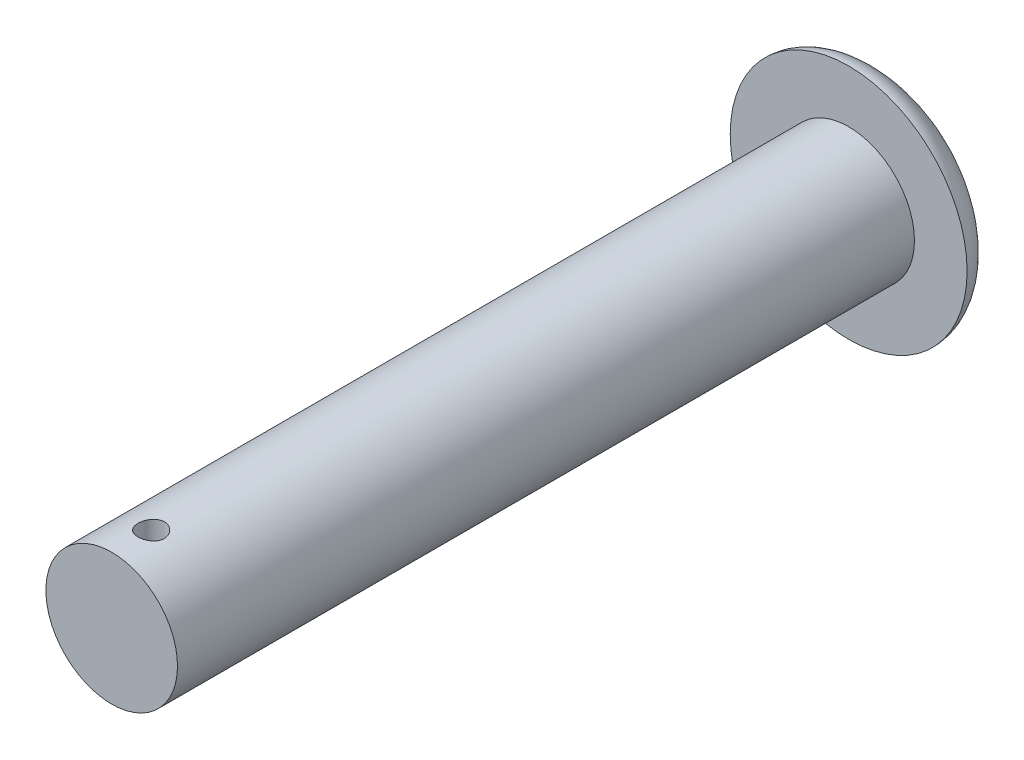
ISO-10303-21;
HEADER;
FILE_DESCRIPTION(('STEP AP214'),'2;1');
FILE_NAME('part.step','',(''),(''),'','','');
FILE_SCHEMA(('AUTOMOTIVE_DESIGN { 1 0 10303 214 1 1 1 1 }'));
ENDSEC;
DATA;
#1=APPLICATION_CONTEXT('core data for automotive mechanical design processes');
#2=APPLICATION_PROTOCOL_DEFINITION('international standard','automotive_design',2000,#1);
#3=PRODUCT_CONTEXT('',#1,'mechanical');
#4=PRODUCT('Part','Part','',(#3));
#5=PRODUCT_RELATED_PRODUCT_CATEGORY('part','',(#4));
#6=PRODUCT_DEFINITION_FORMATION('','',#4);
#7=PRODUCT_DEFINITION_CONTEXT('part definition',#1,'design');
#8=PRODUCT_DEFINITION('design','',#6,#7);
#9=PRODUCT_DEFINITION_SHAPE('','',#8);
#10=(LENGTH_UNIT() NAMED_UNIT(*) SI_UNIT(.MILLI.,.METRE.));
#11=(NAMED_UNIT(*) PLANE_ANGLE_UNIT() SI_UNIT($,.RADIAN.));
#12=(NAMED_UNIT(*) SI_UNIT($,.STERADIAN.) SOLID_ANGLE_UNIT());
#13=UNCERTAINTY_MEASURE_WITH_UNIT(LENGTH_MEASURE(1.E-05),#10,'distance_accuracy_value','');
#14=(GEOMETRIC_REPRESENTATION_CONTEXT(3) GLOBAL_UNCERTAINTY_ASSIGNED_CONTEXT((#13)) GLOBAL_UNIT_ASSIGNED_CONTEXT((#10,
#11,#12)) REPRESENTATION_CONTEXT('',''));
#15=CARTESIAN_POINT('',(0.,0.,0.));
#16=DIRECTION('',(0.,0.,1.));
#17=DIRECTION('',(1.,0.,0.));
#18=AXIS2_PLACEMENT_3D('',#15,#16,#17);
#19=CARTESIAN_POINT('',(-2.5,0.,0.));
#20=DIRECTION('',(0.,0.,-1.));
#21=DIRECTION('',(-1.,0.,0.));
#22=AXIS2_PLACEMENT_3D('',#19,#20,#21);
#23=PLANE('',#22);
#24=CARTESIAN_POINT('',(0.,0.,0.));
#25=DIRECTION('',(0.,0.,1.));
#26=DIRECTION('',(1.,0.,0.));
#27=AXIS2_PLACEMENT_3D('',#24,#25,#26);
#28=CIRCLE('',#27,2.5);
#29=CARTESIAN_POINT('',(2.5,0.,0.));
#30=VERTEX_POINT('',#29);
#31=EDGE_CURVE('E69',#30,#30,#28,.T.);
#32=ORIENTED_EDGE('',*,*,#31,.T.);
#33=EDGE_LOOP('',(#32));
#34=FACE_BOUND('',#33,.T.);
#35=ADVANCED_FACE('F37',(#34),#23,.F.);
#36=CARTESIAN_POINT('',(0.,0.,-28.));
#37=DIRECTION('',(0.,1.,0.));
#38=DIRECTION('',(-1.,0.,0.));
#39=AXIS2_PLACEMENT_3D('',#36,#37,#38);
#40=ELLIPSE('',#39,4.5,2.);
#41=TRIMMED_CURVE('',#40,(PARAMETER_VALUE(4.71238898038469)),
(PARAMETER_VALUE(7.85398163397448)),.T.,.PARAMETER.);
#42=CARTESIAN_POINT('',(0.,0.,0.));
#43=DIRECTION('',(0.,0.,1.));
#44=AXIS1_PLACEMENT('',#42,#43);
#45=SURFACE_OF_REVOLUTION('',#41,#44);
#46=CARTESIAN_POINT('',(0.,0.,-28.));
#47=DIRECTION('',(0.,0.,1.));
#48=DIRECTION('',(1.,0.,0.));
#49=AXIS2_PLACEMENT_3D('',#46,#47,#48);
#50=CIRCLE('',#49,4.5);
#51=CARTESIAN_POINT('',(4.5,0.,-28.));
#52=VERTEX_POINT('',#51);
#53=EDGE_CURVE('E11',#52,#52,#50,.T.);
#54=ORIENTED_EDGE('',*,*,#53,.F.);
#55=EDGE_LOOP('',(#54));
#56=FACE_BOUND('',#55,.T.);
#57=CARTESIAN_POINT('',(0.,0.,-30.));
#58=VERTEX_POINT('',#57);
#59=VERTEX_LOOP('',#58);
#60=FACE_BOUND('',#59,.T.);
#61=ADVANCED_FACE('F53',(#56,#60),#45,.T.);
#62=CARTESIAN_POINT('',(-4.5,0.,-28.));
#63=DIRECTION('',(0.,0.,-1.));
#64=DIRECTION('',(-1.,0.,0.));
#65=AXIS2_PLACEMENT_3D('',#62,#63,#64);
#66=PLANE('',#65);
#67=CARTESIAN_POINT('',(0.,0.,-28.));
#68=DIRECTION('',(0.,0.,1.));
#69=DIRECTION('',(1.,0.,0.));
#70=AXIS2_PLACEMENT_3D('',#67,#68,#69);
#71=CIRCLE('',#70,2.5);
#72=CARTESIAN_POINT('',(2.5,0.,-28.));
#73=VERTEX_POINT('',#72);
#74=EDGE_CURVE('E49',#73,#73,#71,.T.);
#75=ORIENTED_EDGE('',*,*,#74,.F.);
#76=EDGE_LOOP('',(#75));
#77=FACE_BOUND('',#76,.T.);
#78=ORIENTED_EDGE('',*,*,#53,.T.);
#79=EDGE_LOOP('',(#78));
#80=FACE_BOUND('',#79,.T.);
#81=ADVANCED_FACE('F55',(#77,#80),#66,.F.);
#82=CARTESIAN_POINT('',(0.,0.,0.));
#83=DIRECTION('',(0.,0.,1.));
#84=DIRECTION('',(1.,0.,0.));
#85=AXIS2_PLACEMENT_3D('',#82,#83,#84);
#86=CYLINDRICAL_SURFACE('',#85,2.5);
#87=CARTESIAN_POINT('',(0.,-2.5,-1.));
#88=CARTESIAN_POINT('',(0.0277884533963166,-2.49999948790436,-1.00000102224917));
#89=CARTESIAN_POINT('',(0.0555898301007612,-2.49953192589115,-1.00232442148382));
#90=CARTESIAN_POINT('',(0.11040675384451,-2.49771182811616,-1.01154925005762));
#91=CARTESIAN_POINT('',(0.137421658770678,-2.49635858930093,-1.01845431640075));
#92=CARTESIAN_POINT('',(0.189865152631656,-2.49291824639143,-1.03662063681039));
#93=CARTESIAN_POINT('',(0.215295233966567,-2.49083184538359,-1.04787771842234));
#94=CARTESIAN_POINT('',(0.263903994432113,-2.48615199017657,-1.07441612375565));
#95=CARTESIAN_POINT('',(0.287082807537906,-2.48355856617854,-1.0896972078036));
#96=CARTESIAN_POINT('',(0.330846738657432,-2.47811082664985,-1.12406924714572));
#97=CARTESIAN_POINT('',(0.351396975579262,-2.47525372752174,-1.1432041776956));
#98=CARTESIAN_POINT('',(0.389018378304014,-2.46962090226294,-1.18464620819585));
#99=CARTESIAN_POINT('',(0.406089272385212,-2.46684518250212,-1.20695355566756));
#100=CARTESIAN_POINT('',(0.43641587667381,-2.46166220906308,-1.25435809650594));
#101=CARTESIAN_POINT('',(0.449635469432933,-2.45925853682473,-1.27947882189818));
#102=CARTESIAN_POINT('',(0.471652833290154,-2.45513134029209,-1.33164090950204));
#103=CARTESIAN_POINT('',(0.480451041218619,-2.45340774880981,-1.35868208167317));
#104=CARTESIAN_POINT('',(0.493262649942413,-2.45086402626102,-1.41354218195396));
#105=CARTESIAN_POINT('',(0.497337248979388,-2.45003235053594,-1.44134627207111));
#106=CARTESIAN_POINT('',(0.50077606386306,-2.44933187530314,-1.49725491068217));
#107=CARTESIAN_POINT('',(0.50014076135675,-2.4494629773392,-1.52535942816007));
#108=CARTESIAN_POINT('',(0.494227286550909,-2.45066275574092,-1.5806233940105));
#109=CARTESIAN_POINT('',(0.489019270121953,-2.45171726429382,-1.60779070281366));
#110=CARTESIAN_POINT('',(0.474218942311525,-2.45462273080001,-1.6608580383315));
#111=CARTESIAN_POINT('',(0.46462642155034,-2.45647372678889,-1.6867580044595));
#112=CARTESIAN_POINT('',(0.44126239183736,-2.46077809250204,-1.7367576308518));
#113=CARTESIAN_POINT('',(0.427463075616057,-2.46323544906852,-1.76084393978459));
#114=CARTESIAN_POINT('',(0.39609678728634,-2.46847309386531,-1.80638542498641));
#115=CARTESIAN_POINT('',(0.378529382178415,-2.47125341919183,-1.82784029842558));
#116=CARTESIAN_POINT('',(0.339749967280292,-2.47688510620731,-1.86791470122847));
#117=CARTESIAN_POINT('',(0.318478080606223,-2.47973684605452,-1.88647628392957));
#118=CARTESIAN_POINT('',(0.273092512031005,-2.48514424357204,-1.91977692315061));
#119=CARTESIAN_POINT('',(0.248978793689695,-2.48769989744487,-1.93451593064679));
#120=CARTESIAN_POINT('',(0.19852969343946,-2.49223345080444,-1.95976375461299));
#121=CARTESIAN_POINT('',(0.17219090979265,-2.49421044424136,-1.97026594682227));
#122=CARTESIAN_POINT('',(0.118074488224333,-2.49735704493929,-1.98668023701928));
#123=CARTESIAN_POINT('',(0.0902970250362249,-2.49852675000266,-1.99259289103681));
#124=CARTESIAN_POINT('',(0.0345897028135754,-2.49991335933434,-1.99957822689714));
#125=CARTESIAN_POINT('',(0.00667016416278829,-2.50014587326235,-2.00073020977013));
#126=CARTESIAN_POINT('',(-0.0489624670963569,-2.49967525965051,-1.99837507052891));
#127=CARTESIAN_POINT('',(-0.0766755712218965,-2.49897218470723,-1.9948682103237));
#128=CARTESIAN_POINT('',(-0.13085282997327,-2.49671916004009,-1.98336081322802));
#129=CARTESIAN_POINT('',(-0.157325974169952,-2.49517688202103,-1.97540096575105));
#130=CARTESIAN_POINT('',(-0.208561813749834,-2.49141776030516,-1.9552580086721));
#131=CARTESIAN_POINT('',(-0.23332438081877,-2.48920086607113,-1.94307458266159));
#132=CARTESIAN_POINT('',(-0.280770586843109,-2.48429955766647,-1.91465875467434));
#133=CARTESIAN_POINT('',(-0.303425063376094,-2.48160975218526,-1.89837860948053));
#134=CARTESIAN_POINT('',(-0.345709009559603,-2.47607367414941,-1.86229540439636));
#135=CARTESIAN_POINT('',(-0.365338154465381,-2.47322738484194,-1.84249196680007));
#136=CARTESIAN_POINT('',(-0.401320295387088,-2.46764651778482,-1.79956332405444));
#137=CARTESIAN_POINT('',(-0.417618851224328,-2.46491430116652,-1.77639212788933));
#138=CARTESIAN_POINT('',(-0.446092710025603,-2.45992095898097,-1.72759431932166));
#139=CARTESIAN_POINT('',(-0.458268177961451,-2.45765981456671,-1.70196780521322));
#140=CARTESIAN_POINT('',(-0.47807592079098,-2.45388370292191,-1.64911587692523));
#141=CARTESIAN_POINT('',(-0.485731749895525,-2.45236487436093,-1.62189957939484));
#142=CARTESIAN_POINT('',(-0.496354325813598,-2.45023718396013,-1.56653327325455));
#143=CARTESIAN_POINT('',(-0.499321684112556,-2.44962820345556,-1.53838338689533));
#144=CARTESIAN_POINT('',(-0.500460455433734,-2.4493957481569,-1.48249556772784));
#145=CARTESIAN_POINT('',(-0.498717894035448,-2.4497545959465,-1.4547594255365));
#146=CARTESIAN_POINT('',(-0.49067615205003,-2.45137786742307,-1.39998417504749));
#147=CARTESIAN_POINT('',(-0.484377008064649,-2.45264228383585,-1.3729450611526));
#148=CARTESIAN_POINT('',(-0.467439284249477,-2.45592632109579,-1.32038614437973));
#149=CARTESIAN_POINT('',(-0.456811253358672,-2.45794410509415,-1.29486281974879));
#150=CARTESIAN_POINT('',(-0.431527322300802,-2.46250857487085,-1.24594813963278));
#151=CARTESIAN_POINT('',(-0.416871084387441,-2.46505530499447,-1.22255696313743));
#152=CARTESIAN_POINT('',(-0.383652957393207,-2.47044480261613,-1.17814221392484));
#153=CARTESIAN_POINT('',(-0.36502894361759,-2.4732918645485,-1.1571656173662));
#154=CARTESIAN_POINT('',(-0.32453218450657,-2.47893040935977,-1.11860689723541));
#155=CARTESIAN_POINT('',(-0.302658693576667,-2.48172187931592,-1.10102555484136));
#156=CARTESIAN_POINT('',(-0.256008814544123,-2.48696916193986,-1.06958267802678));
#157=CARTESIAN_POINT('',(-0.231204442214917,-2.48942115609623,-1.05576199835999));
#158=CARTESIAN_POINT('',(-0.179583180470366,-2.493675625425,-1.0325069387017));
#159=CARTESIAN_POINT('',(-0.152768130431563,-2.49547868569308,-1.02306860523375));
#160=CARTESIAN_POINT('',(-0.10491074446189,-2.49788186297685,-1.01067402597764));
#161=CARTESIAN_POINT('',(-0.0841408320068923,-2.49867151579226,-1.00667840314612));
#162=CARTESIAN_POINT('',(-0.0422497626050335,-2.49973077069946,-1.00134104382082));
#163=CARTESIAN_POINT('',(-0.0211286168743095,-2.50000038936577,-0.999999222745116));
#164=CARTESIAN_POINT('',(0.,-2.5,-1.));
#165=B_SPLINE_CURVE_WITH_KNOTS('',3,(#87,#88,#89,#90,#91,#92,#93,#94,#95,#96,#97,#98,#99,#100,
#101,#102,#103,#104,#105,#106,#107,#108,#109,#110,#111,#112,#113,#114,#115,#116,#117,#118,#119,
#120,#121,#122,#123,#124,#125,#126,#127,#128,#129,#130,#131,#132,#133,#134,#135,#136,#137,#138,
#139,#140,#141,#142,#143,#144,#145,#146,#147,#148,#149,#150,#151,#152,#153,#154,#155,#156,#157,
#158,#159,#160,#161,#162,#163,#164),.UNSPECIFIED.,.T.,.F.,(4,2,2,2,2,2,2,2,2,2,2,2,2,2,2,2,2,2,
2,2,2,2,2,2,2,2,2,2,2,2,2,2,2,2,2,2,2,2,4),(0.,0.0832880653306292,0.166642325345661,
0.249916867625171,0.333186451115431,0.417466335056093,0.501752798373682,0.586805975029613,
0.671850746825987,0.755780925517936,0.839702521406126,0.922358635031391,1.00501869626865,
1.08823745101796,1.17146577374835,1.25619126245675,1.3409178376991,1.42577637427012,
1.51062462849018,1.59405367838133,1.67747803828934,1.76015226975362,1.84283269608011,
1.92652533016679,2.01022694172965,2.09520314289613,2.18017594361733,2.26470190516362,
2.34921684165207,2.43219861283851,2.51517971746304,2.59795980626555,2.68074683790933,
2.76494038119571,2.84915327266465,2.93424748337818,3.01926477758759,3.08259387644947,
3.14592095685498),.UNSPECIFIED.);
#166=CARTESIAN_POINT('',(0.,-2.5,-1.));
#167=VERTEX_POINT('',#166);
#168=EDGE_CURVE('E40',#167,#167,#165,.T.);
#169=ORIENTED_EDGE('',*,*,#168,.T.);
#170=EDGE_LOOP('',(#169));
#171=FACE_BOUND('',#170,.T.);
#172=CARTESIAN_POINT('',(0.,2.5,-1.));
#173=CARTESIAN_POINT('',(-0.0277884533963166,2.49999948790436,-1.00000102224917));
#174=CARTESIAN_POINT('',(-0.0555898301007612,2.49953192589115,-1.00232442148382));
#175=CARTESIAN_POINT('',(-0.11040675384451,2.49771182811616,-1.01154925005762));
#176=CARTESIAN_POINT('',(-0.137421658770678,2.49635858930093,-1.01845431640075));
#177=CARTESIAN_POINT('',(-0.189865152631656,2.49291824639143,-1.03662063681039));
#178=CARTESIAN_POINT('',(-0.215295233966567,2.49083184538359,-1.04787771842234));
#179=CARTESIAN_POINT('',(-0.263903994432113,2.48615199017657,-1.07441612375565));
#180=CARTESIAN_POINT('',(-0.287082807537906,2.48355856617854,-1.0896972078036));
#181=CARTESIAN_POINT('',(-0.330846738657432,2.47811082664985,-1.12406924714572));
#182=CARTESIAN_POINT('',(-0.351396975579262,2.47525372752174,-1.1432041776956));
#183=CARTESIAN_POINT('',(-0.389018378304014,2.46962090226294,-1.18464620819585));
#184=CARTESIAN_POINT('',(-0.406089272385212,2.46684518250212,-1.20695355566756));
#185=CARTESIAN_POINT('',(-0.43641587667381,2.46166220906308,-1.25435809650594));
#186=CARTESIAN_POINT('',(-0.449635469432933,2.45925853682473,-1.27947882189818));
#187=CARTESIAN_POINT('',(-0.471652833290154,2.45513134029209,-1.33164090950204));
#188=CARTESIAN_POINT('',(-0.480451041218619,2.45340774880981,-1.35868208167317));
#189=CARTESIAN_POINT('',(-0.493262649942413,2.45086402626102,-1.41354218195396));
#190=CARTESIAN_POINT('',(-0.497337248979388,2.45003235053594,-1.44134627207111));
#191=CARTESIAN_POINT('',(-0.50077606386306,2.44933187530314,-1.49725491068217));
#192=CARTESIAN_POINT('',(-0.50014076135675,2.4494629773392,-1.52535942816007));
#193=CARTESIAN_POINT('',(-0.494227286550909,2.45066275574092,-1.5806233940105));
#194=CARTESIAN_POINT('',(-0.489019270121953,2.45171726429382,-1.60779070281366));
#195=CARTESIAN_POINT('',(-0.474218942311525,2.45462273080001,-1.6608580383315));
#196=CARTESIAN_POINT('',(-0.46462642155034,2.45647372678889,-1.6867580044595));
#197=CARTESIAN_POINT('',(-0.44126239183736,2.46077809250204,-1.7367576308518));
#198=CARTESIAN_POINT('',(-0.427463075616057,2.46323544906852,-1.76084393978459));
#199=CARTESIAN_POINT('',(-0.39609678728634,2.46847309386531,-1.80638542498641));
#200=CARTESIAN_POINT('',(-0.378529382178415,2.47125341919183,-1.82784029842558));
#201=CARTESIAN_POINT('',(-0.339749967280292,2.47688510620731,-1.86791470122847));
#202=CARTESIAN_POINT('',(-0.318478080606223,2.47973684605452,-1.88647628392957));
#203=CARTESIAN_POINT('',(-0.273092512031005,2.48514424357204,-1.91977692315061));
#204=CARTESIAN_POINT('',(-0.248978793689695,2.48769989744487,-1.93451593064679));
#205=CARTESIAN_POINT('',(-0.19852969343946,2.49223345080444,-1.95976375461299));
#206=CARTESIAN_POINT('',(-0.17219090979265,2.49421044424136,-1.97026594682227));
#207=CARTESIAN_POINT('',(-0.118074488224333,2.49735704493929,-1.98668023701928));
#208=CARTESIAN_POINT('',(-0.0902970250362249,2.49852675000266,-1.99259289103681));
#209=CARTESIAN_POINT('',(-0.0345897028135754,2.49991335933434,-1.99957822689714));
#210=CARTESIAN_POINT('',(-0.00667016416278829,2.50014587326235,-2.00073020977013));
#211=CARTESIAN_POINT('',(0.0489624670963569,2.49967525965051,-1.99837507052891));
#212=CARTESIAN_POINT('',(0.0766755712218965,2.49897218470723,-1.9948682103237));
#213=CARTESIAN_POINT('',(0.13085282997327,2.49671916004009,-1.98336081322802));
#214=CARTESIAN_POINT('',(0.157325974169952,2.49517688202103,-1.97540096575105));
#215=CARTESIAN_POINT('',(0.208561813749834,2.49141776030516,-1.9552580086721));
#216=CARTESIAN_POINT('',(0.23332438081877,2.48920086607113,-1.94307458266159));
#217=CARTESIAN_POINT('',(0.280770586843109,2.48429955766647,-1.91465875467434));
#218=CARTESIAN_POINT('',(0.303425063376094,2.48160975218526,-1.89837860948053));
#219=CARTESIAN_POINT('',(0.345709009559603,2.47607367414941,-1.86229540439636));
#220=CARTESIAN_POINT('',(0.365338154465381,2.47322738484194,-1.84249196680007));
#221=CARTESIAN_POINT('',(0.401320295387088,2.46764651778482,-1.79956332405444));
#222=CARTESIAN_POINT('',(0.417618851224328,2.46491430116652,-1.77639212788933));
#223=CARTESIAN_POINT('',(0.446092710025603,2.45992095898097,-1.72759431932166));
#224=CARTESIAN_POINT('',(0.458268177961451,2.45765981456671,-1.70196780521322));
#225=CARTESIAN_POINT('',(0.47807592079098,2.45388370292191,-1.64911587692523));
#226=CARTESIAN_POINT('',(0.485731749895525,2.45236487436093,-1.62189957939484));
#227=CARTESIAN_POINT('',(0.496354325813598,2.45023718396013,-1.56653327325455));
#228=CARTESIAN_POINT('',(0.499321684112556,2.44962820345556,-1.53838338689533));
#229=CARTESIAN_POINT('',(0.500460455433734,2.4493957481569,-1.48249556772784));
#230=CARTESIAN_POINT('',(0.498717894035448,2.4497545959465,-1.4547594255365));
#231=CARTESIAN_POINT('',(0.49067615205003,2.45137786742307,-1.39998417504749));
#232=CARTESIAN_POINT('',(0.484377008064649,2.45264228383585,-1.3729450611526));
#233=CARTESIAN_POINT('',(0.467439284249477,2.45592632109579,-1.32038614437973));
#234=CARTESIAN_POINT('',(0.456811253358672,2.45794410509415,-1.29486281974879));
#235=CARTESIAN_POINT('',(0.431527322300802,2.46250857487085,-1.24594813963278));
#236=CARTESIAN_POINT('',(0.416871084387441,2.46505530499447,-1.22255696313743));
#237=CARTESIAN_POINT('',(0.383652957393207,2.47044480261613,-1.17814221392484));
#238=CARTESIAN_POINT('',(0.36502894361759,2.4732918645485,-1.1571656173662));
#239=CARTESIAN_POINT('',(0.32453218450657,2.47893040935977,-1.11860689723541));
#240=CARTESIAN_POINT('',(0.302658693576667,2.48172187931592,-1.10102555484136));
#241=CARTESIAN_POINT('',(0.256008814544123,2.48696916193986,-1.06958267802678));
#242=CARTESIAN_POINT('',(0.231204442214917,2.48942115609623,-1.05576199835999));
#243=CARTESIAN_POINT('',(0.179583180470366,2.493675625425,-1.0325069387017));
#244=CARTESIAN_POINT('',(0.152768130431563,2.49547868569308,-1.02306860523375));
#245=CARTESIAN_POINT('',(0.10491074446189,2.49788186297685,-1.01067402597764));
#246=CARTESIAN_POINT('',(0.0841408320068923,2.49867151579226,-1.00667840314612));
#247=CARTESIAN_POINT('',(0.0422497626050335,2.49973077069946,-1.00134104382082));
#248=CARTESIAN_POINT('',(0.0211286168743095,2.50000038936577,-0.999999222745116));
#249=CARTESIAN_POINT('',(0.,2.5,-1.));
#250=B_SPLINE_CURVE_WITH_KNOTS('',3,(#172,#173,#174,#175,#176,#177,#178,#179,#180,#181,#182,
#183,#184,#185,#186,#187,#188,#189,#190,#191,#192,#193,#194,#195,#196,#197,#198,#199,#200,#201,
#202,#203,#204,#205,#206,#207,#208,#209,#210,#211,#212,#213,#214,#215,#216,#217,#218,#219,#220,
#221,#222,#223,#224,#225,#226,#227,#228,#229,#230,#231,#232,#233,#234,#235,#236,#237,#238,#239,
#240,#241,#242,#243,#244,#245,#246,#247,#248,#249),.UNSPECIFIED.,.T.,.F.,(4,2,2,2,2,2,2,2,2,2,2,
2,2,2,2,2,2,2,2,2,2,2,2,2,2,2,2,2,2,2,2,2,2,2,2,2,2,2,4),(0.,0.0832880653306292,
0.166642325345661,0.249916867625171,0.333186451115431,0.417466335056093,0.501752798373682,
0.586805975029613,0.671850746825987,0.755780925517936,0.839702521406126,0.922358635031391,
1.00501869626865,1.08823745101796,1.17146577374835,1.25619126245675,1.3409178376991,
1.42577637427012,1.51062462849018,1.59405367838133,1.67747803828934,1.76015226975362,
1.84283269608011,1.92652533016679,2.01022694172965,2.09520314289613,2.18017594361733,
2.26470190516362,2.34921684165207,2.43219861283851,2.51517971746304,2.59795980626555,
2.68074683790933,2.76494038119571,2.84915327266465,2.93424748337818,3.01926477758759,
3.08259387644947,3.14592095685498),.UNSPECIFIED.);
#251=CARTESIAN_POINT('',(0.,2.5,-1.));
#252=VERTEX_POINT('',#251);
#253=EDGE_CURVE('E73',#252,#252,#250,.T.);
#254=ORIENTED_EDGE('',*,*,#253,.T.);
#255=EDGE_LOOP('',(#254));
#256=FACE_BOUND('',#255,.T.);
#257=ORIENTED_EDGE('',*,*,#31,.F.);
#258=EDGE_LOOP('',(#257));
#259=FACE_BOUND('',#258,.T.);
#260=ORIENTED_EDGE('',*,*,#74,.T.);
#261=EDGE_LOOP('',(#260));
#262=FACE_BOUND('',#261,.T.);
#263=ADVANCED_FACE('F61',(#171,#256,#259,#262),#86,.T.);
#264=CARTESIAN_POINT('',(0.,-4.5,-1.5));
#265=DIRECTION('',(0.,1.,0.));
#266=DIRECTION('',(0.,0.,1.));
#267=AXIS2_PLACEMENT_3D('',#264,#265,#266);
#268=CYLINDRICAL_SURFACE('',#267,0.5);
#269=ORIENTED_EDGE('',*,*,#253,.F.);
#270=EDGE_LOOP('',(#269));
#271=FACE_BOUND('',#270,.T.);
#272=ORIENTED_EDGE('',*,*,#168,.F.);
#273=EDGE_LOOP('',(#272));
#274=FACE_BOUND('',#273,.T.);
#275=ADVANCED_FACE('F79',(#271,#274),#268,.F.);
#276=CLOSED_SHELL('',(#35,#61,#81,#263,#275));
#277=MANIFOLD_SOLID_BREP('B2',#276);
#278=ADVANCED_BREP_SHAPE_REPRESENTATION('',(#18,#277),#14);
#279=SHAPE_DEFINITION_REPRESENTATION(#9,#278);
ENDSEC;
END-ISO-10303-21;
